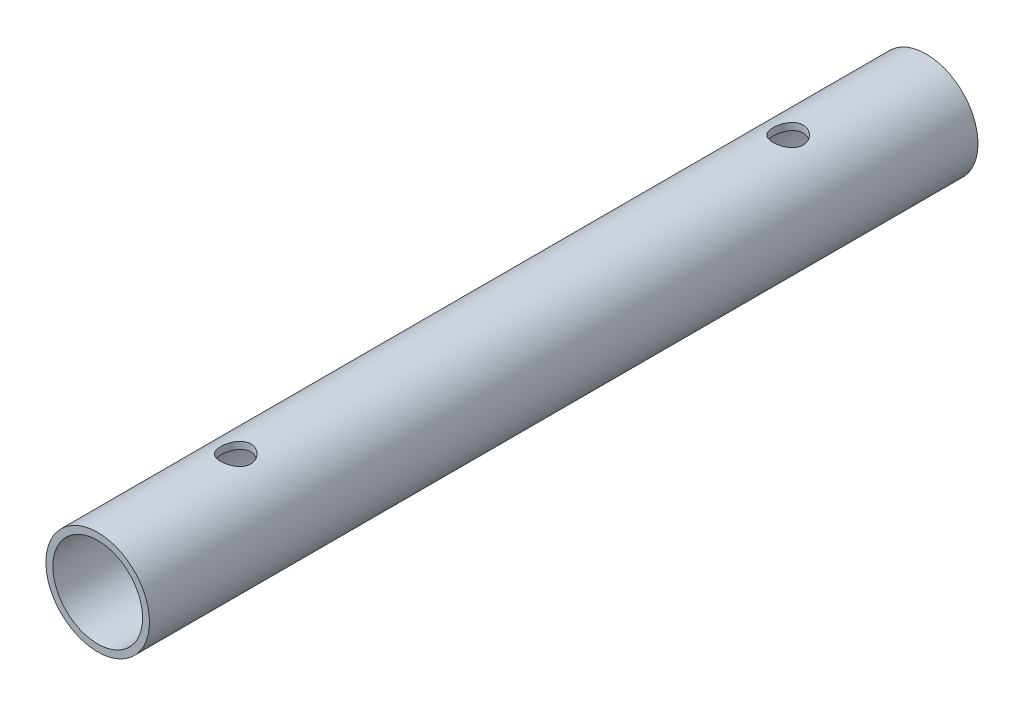
ISO-10303-21;
HEADER;
FILE_DESCRIPTION(('STEP AP214'),'2;1');
FILE_NAME('part.step','',(''),(''),'','','');
FILE_SCHEMA(('AUTOMOTIVE_DESIGN { 1 0 10303 214 1 1 1 1 }'));
ENDSEC;
DATA;
#1=APPLICATION_CONTEXT('core data for automotive mechanical design processes');
#2=APPLICATION_PROTOCOL_DEFINITION('international standard','automotive_design',2000,#1);
#3=PRODUCT_CONTEXT('',#1,'mechanical');
#4=PRODUCT('Part','Part','',(#3));
#5=PRODUCT_RELATED_PRODUCT_CATEGORY('part','',(#4));
#6=PRODUCT_DEFINITION_FORMATION('','',#4);
#7=PRODUCT_DEFINITION_CONTEXT('part definition',#1,'design');
#8=PRODUCT_DEFINITION('design','',#6,#7);
#9=PRODUCT_DEFINITION_SHAPE('','',#8);
#10=(LENGTH_UNIT() NAMED_UNIT(*) SI_UNIT(.MILLI.,.METRE.));
#11=(NAMED_UNIT(*) PLANE_ANGLE_UNIT() SI_UNIT($,.RADIAN.));
#12=(NAMED_UNIT(*) SI_UNIT($,.STERADIAN.) SOLID_ANGLE_UNIT());
#13=UNCERTAINTY_MEASURE_WITH_UNIT(LENGTH_MEASURE(1.E-05),#10,'distance_accuracy_value','');
#14=(GEOMETRIC_REPRESENTATION_CONTEXT(3) GLOBAL_UNCERTAINTY_ASSIGNED_CONTEXT((#13)) GLOBAL_UNIT_ASSIGNED_CONTEXT((#10,
#11,#12)) REPRESENTATION_CONTEXT('',''));
#15=CARTESIAN_POINT('',(0.,0.,0.));
#16=DIRECTION('',(0.,0.,1.));
#17=DIRECTION('',(1.,0.,0.));
#18=AXIS2_PLACEMENT_3D('',#15,#16,#17);
#19=CARTESIAN_POINT('',(0.,0.,-358.681536726415));
#20=DIRECTION('',(0.,0.,1.));
#21=DIRECTION('',(1.,0.,0.));
#22=AXIS2_PLACEMENT_3D('',#19,#20,#21);
#23=CYLINDRICAL_SURFACE('',#22,19.05);
#24=CARTESIAN_POINT('',(0.,0.,0.));
#25=DIRECTION('',(0.,0.,1.));
#26=DIRECTION('',(1.,0.,0.));
#27=AXIS2_PLACEMENT_3D('',#24,#25,#26);
#28=CIRCLE('',#27,19.05);
#29=CARTESIAN_POINT('',(19.05,0.,0.));
#30=VERTEX_POINT('',#29);
#31=EDGE_CURVE('E48',#30,#30,#28,.T.);
#32=ORIENTED_EDGE('',*,*,#31,.F.);
#33=EDGE_LOOP('',(#32));
#34=FACE_BOUND('',#33,.T.);
#35=CARTESIAN_POINT('',(0.,0.,-304.8));
#36=DIRECTION('',(0.,0.,-1.));
#37=DIRECTION('',(0.,1.,0.));
#38=AXIS2_PLACEMENT_3D('',#35,#36,#37);
#39=CIRCLE('',#38,19.05);
#40=CARTESIAN_POINT('',(0.,19.05,-304.8));
#41=VERTEX_POINT('',#40);
#42=EDGE_CURVE('E57',#41,#41,#39,.F.);
#43=ORIENTED_EDGE('',*,*,#42,.T.);
#44=EDGE_LOOP('',(#43));
#45=FACE_BOUND('',#44,.T.);
#46=CARTESIAN_POINT('',(0.,19.05,-56.35625));
#47=CARTESIAN_POINT('',(0.305197852957572,19.0499967593656,-56.3562452855948));
#48=CARTESIAN_POINT('',(0.610443721254728,19.04259502865,-56.3310201483082));
#49=CARTESIAN_POINT('',(1.21207106492609,19.0137899802685,-56.2310095974832));
#50=CARTESIAN_POINT('',(1.50844944236132,18.9923818277056,-56.156207070137));
#51=CARTESIAN_POINT('',(2.08357574543337,18.9379141773575,-55.9597337553705));
#52=CARTESIAN_POINT('',(2.36234818506784,18.9048713209344,-55.8381298859044));
#53=CARTESIAN_POINT('',(2.89554578253322,18.8305835067855,-55.5517734479198));
#54=CARTESIAN_POINT('',(3.14996809945047,18.7893375937379,-55.3870158530418));
#55=CARTESIAN_POINT('',(3.63418633990808,18.7017985246687,-55.0142885747957));
#56=CARTESIAN_POINT('',(3.8632236566638,18.6554062618649,-54.8053566837375));
#57=CARTESIAN_POINT('',(4.28355654099156,18.5634058154964,-54.352263885439));
#58=CARTESIAN_POINT('',(4.47484617120299,18.5177977563079,-54.1080974465714));
#59=CARTESIAN_POINT('',(4.81816843938339,18.4314904262148,-53.5851428068572));
#60=CARTESIAN_POINT('',(4.96928907087044,18.3909148222254,-53.3057335529916));
#61=CARTESIAN_POINT('',(5.22209367570295,18.3207416053292,-52.7240942075278));
#62=CARTESIAN_POINT('',(5.32378878913775,18.2911415189916,-52.421869276147));
#63=CARTESIAN_POINT('',(5.47214625291467,18.247301082059,-51.81166730067));
#64=CARTESIAN_POINT('',(5.52020133630383,18.2326728793863,-51.5040574645368));
#65=CARTESIAN_POINT('',(5.56426199642803,18.2192773099229,-50.8848207872725));
#66=CARTESIAN_POINT('',(5.56027941268827,18.2205063353207,-50.5731948759908));
#67=CARTESIAN_POINT('',(5.50147475001922,18.2383417195535,-49.9659759041382));
#68=CARTESIAN_POINT('',(5.44838154643727,18.2544251203865,-49.6701975373336));
#69=CARTESIAN_POINT('',(5.29564973051496,18.299313291821,-49.091942675106));
#70=CARTESIAN_POINT('',(5.19600675179311,18.3281192557886,-48.8094674302563));
#71=CARTESIAN_POINT('',(4.95169587736092,18.3956350696536,-48.2615367254907));
#72=CARTESIAN_POINT('',(4.80645560148868,18.4344696423172,-47.9963525008436));
#73=CARTESIAN_POINT('',(4.47547110285111,18.5176052201316,-47.4935335128724));
#74=CARTESIAN_POINT('',(4.28971753138748,18.5619074859608,-47.2559051276496));
#75=CARTESIAN_POINT('',(3.87432679086706,18.6531222739158,-46.8051178353809));
#76=CARTESIAN_POINT('',(3.64325026483736,18.7000689061365,-46.5932899910498));
#77=CARTESIAN_POINT('',(3.14827065571151,18.7897329549577,-46.2110917910002));
#78=CARTESIAN_POINT('',(2.88436572714628,18.8324501335542,-46.0407237675642));
#79=CARTESIAN_POINT('',(2.32889511331043,18.9091967961887,-45.7455322566976));
#80=CARTESIAN_POINT('',(2.03717211372351,18.9431722966634,-45.6209898226991));
#81=CARTESIAN_POINT('',(1.43570302112554,18.9982185370377,-45.4231210825474));
#82=CARTESIAN_POINT('',(1.12596169270964,19.0192926716187,-45.3497813029444));
#83=CARTESIAN_POINT('',(0.508575303740116,19.0456308433475,-45.2585827413815));
#84=CARTESIAN_POINT('',(0.201218464925073,19.0514091475778,-45.2389185739891));
#85=CARTESIAN_POINT('',(-0.41241648279452,19.048005485797,-45.2505885632524));
#86=CARTESIAN_POINT('',(-0.71869472225038,19.038825397383,-45.2819163193348));
#87=CARTESIAN_POINT('',(-1.31476061235856,19.006872072053,-45.3932149881674));
#88=CARTESIAN_POINT('',(-1.60476000906639,18.9843903388586,-45.4721434341759));
#89=CARTESIAN_POINT('',(-2.16734740494981,18.9284202360177,-45.675160171376));
#90=CARTESIAN_POINT('',(-2.43993335134991,18.8949305715561,-45.7992537753329));
#91=CARTESIAN_POINT('',(-2.9666964196714,18.8195015702674,-46.0921904479054));
#92=CARTESIAN_POINT('',(-3.22032824532238,18.7773906362024,-46.2619687247643));
#93=CARTESIAN_POINT('',(-3.69612215069487,18.6895643238074,-46.6403091487581));
#94=CARTESIAN_POINT('',(-3.91827674742734,18.6438480924078,-46.8488804908919));
#95=CARTESIAN_POINT('',(-4.33267353503362,18.5520102172859,-47.3073582374873));
#96=CARTESIAN_POINT('',(-4.52363339074842,18.5059281492268,-47.5584340415914));
#97=CARTESIAN_POINT('',(-4.86078376290735,18.4202511103015,-48.0900643884328));
#98=CARTESIAN_POINT('',(-5.00697569449914,18.380655934398,-48.3706179989779));
#99=CARTESIAN_POINT('',(-5.2493975394054,18.3128967342081,-48.9521787919837));
#100=CARTESIAN_POINT('',(-5.34588042295199,18.2846749935688,-49.2530734175867));
#101=CARTESIAN_POINT('',(-5.48655310120297,18.2429636363391,-49.8678057224405));
#102=CARTESIAN_POINT('',(-5.53075958266918,18.2294693188235,-50.1816392384444));
#103=CARTESIAN_POINT('',(-5.56453342166491,18.2191860189346,-50.8000715682928));
#104=CARTESIAN_POINT('',(-5.55618304605885,18.22176037238,-51.1045476189261));
#105=CARTESIAN_POINT('',(-5.49001416113235,18.2418040071718,-51.7075511849054));
#106=CARTESIAN_POINT('',(-5.43219743485723,18.2592727516405,-52.0060789142653));
#107=CARTESIAN_POINT('',(-5.27004750008392,18.3067217834013,-52.5855126310295));
#108=CARTESIAN_POINT('',(-5.16623697127978,18.336561249887,-52.8665772594015));
#109=CARTESIAN_POINT('',(-4.91545129484854,18.4053706773781,-53.4075235064469));
#110=CARTESIAN_POINT('',(-4.76846824512327,18.4443423096286,-53.6674012360337));
#111=CARTESIAN_POINT('',(-4.42954181865279,18.5287105848625,-54.1683323230018));
#112=CARTESIAN_POINT('',(-4.23621715797442,18.5742830513715,-54.4084215281945));
#113=CARTESIAN_POINT('',(-3.81261787180827,18.6658331490876,-54.8534262206816));
#114=CARTESIAN_POINT('',(-3.58233383745699,18.7118108806401,-55.0583327238386));
#115=CARTESIAN_POINT('',(-3.08383042936397,18.8004843675626,-55.4326727624395));
#116=CARTESIAN_POINT('',(-2.81475200197527,18.843057385642,-55.6009942592762));
#117=CARTESIAN_POINT('',(-2.25087323533568,18.9186883530335,-55.8897639173367));
#118=CARTESIAN_POINT('',(-1.95608622414199,18.9517511949234,-56.0102367068599));
#119=CARTESIAN_POINT('',(-1.3862214397385,19.0013821268529,-56.1877875140526));
#120=CARTESIAN_POINT('',(-1.11311117563594,19.0194679486894,-56.2507964090226));
#121=CARTESIAN_POINT('',(-0.56001340421481,19.0437775008748,-56.3350267461973));
#122=CARTESIAN_POINT('',(-0.280026913051773,19.0500029733657,-56.3562543255886));
#123=CARTESIAN_POINT('',(0.,19.05,-56.35625));
#124=B_SPLINE_CURVE_WITH_KNOTS('',3,(#46,#47,#48,#49,#50,#51,#52,#53,#54,#55,#56,#57,#58,#59,
#60,#61,#62,#63,#64,#65,#66,#67,#68,#69,#70,#71,#72,#73,#74,#75,#76,#77,#78,#79,#80,#81,#82,#83,
#84,#85,#86,#87,#88,#89,#90,#91,#92,#93,#94,#95,#96,#97,#98,#99,#100,#101,#102,#103,#104,#105,
#106,#107,#108,#109,#110,#111,#112,#113,#114,#115,#116,#117,#118,#119,#120,#121,#122,#123),
.UNSPECIFIED.,.T.,.F.,(4,2,2,2,2,2,2,2,2,2,2,2,2,2,2,2,2,2,2,2,2,2,2,2,2,2,2,2,2,2,2,2,2,2,2,2,
2,2,4),(0.,0.914565397239843,1.82944666132989,2.74302463181422,3.65670905927188,
4.59284136918555,5.52912080685836,6.48512645713506,7.44091653186592,8.37126685477797,
9.30140550958779,10.1999971835512,11.0986731625854,12.0091144550199,12.9197660602199,
13.8662568603019,14.8128008920191,15.7650570613528,16.7170625597679,17.6366279867662,
18.5560779976049,19.4560880742055,20.3562040529807,21.2763697970838,22.1967539237818,
23.1486047804499,24.1004255452921,25.0473534055484,25.9939789223403,26.9033423712759,
27.8126730430221,28.7119249232661,29.6113415010842,30.5419197534044,31.4727352828109,
32.4287806250415,33.3843332396459,34.2235939007218,35.0627312750225),.UNSPECIFIED.);
#125=CARTESIAN_POINT('',(0.,19.05,-56.35625));
#126=VERTEX_POINT('',#125);
#127=EDGE_CURVE('E59',#126,#126,#124,.T.);
#128=ORIENTED_EDGE('',*,*,#127,.T.);
#129=EDGE_LOOP('',(#128));
#130=FACE_BOUND('',#129,.T.);
#131=CARTESIAN_POINT('',(2.55069435326411E-13,19.05,-259.55625));
#132=CARTESIAN_POINT('',(0.305197852957828,19.0499967593656,-259.556245285595));
#133=CARTESIAN_POINT('',(0.610443721254984,19.04259502865,-259.531020148308));
#134=CARTESIAN_POINT('',(1.21207106492634,19.0137899802685,-259.431009597483));
#135=CARTESIAN_POINT('',(1.50844944236157,18.9923818277055,-259.356207070137));
#136=CARTESIAN_POINT('',(2.08357574543362,18.9379141773575,-259.159733755371));
#137=CARTESIAN_POINT('',(2.36234818506809,18.9048713209344,-259.038129885904));
#138=CARTESIAN_POINT('',(2.89554578253347,18.8305835067855,-258.75177344792));
#139=CARTESIAN_POINT('',(3.14996809945071,18.7893375937379,-258.587015853042));
#140=CARTESIAN_POINT('',(3.63418633990831,18.7017985246686,-258.214288574796));
#141=CARTESIAN_POINT('',(3.86322365666404,18.6554062618648,-258.005356683737));
#142=CARTESIAN_POINT('',(4.28355654099181,18.5634058154963,-257.552263885439));
#143=CARTESIAN_POINT('',(4.47484617120324,18.5177977563078,-257.308097446571));
#144=CARTESIAN_POINT('',(4.81816843938362,18.4314904262147,-256.785142806857));
#145=CARTESIAN_POINT('',(4.96928907087067,18.3909148222253,-256.505733552992));
#146=CARTESIAN_POINT('',(5.22209367570318,18.3207416053292,-255.924094207528));
#147=CARTESIAN_POINT('',(5.32378878913798,18.2911415189916,-255.621869276147));
#148=CARTESIAN_POINT('',(5.4721462529149,18.247301082059,-255.01166730067));
#149=CARTESIAN_POINT('',(5.52020133630405,18.2326728793862,-254.704057464537));
#150=CARTESIAN_POINT('',(5.56426199642825,18.2192773099228,-254.084820787272));
#151=CARTESIAN_POINT('',(5.56027941268849,18.2205063353206,-253.773194875991));
#152=CARTESIAN_POINT('',(5.50147475001944,18.2383417195535,-253.165975904138));
#153=CARTESIAN_POINT('',(5.44838154643748,18.2544251203864,-252.870197537334));
#154=CARTESIAN_POINT('',(5.29564973051516,18.299313291821,-252.291942675106));
#155=CARTESIAN_POINT('',(5.19600675179333,18.3281192557885,-252.009467430256));
#156=CARTESIAN_POINT('',(4.95169587736115,18.3956350696535,-251.461536725491));
#157=CARTESIAN_POINT('',(4.80645560148891,18.4344696423172,-251.196352500844));
#158=CARTESIAN_POINT('',(4.47547110285133,18.5176052201315,-250.693533512872));
#159=CARTESIAN_POINT('',(4.2897175313877,18.5619074859608,-250.45590512765));
#160=CARTESIAN_POINT('',(3.87432679086727,18.6531222739158,-250.005117835381));
#161=CARTESIAN_POINT('',(3.64325026483758,18.7000689061365,-249.79328999105));
#162=CARTESIAN_POINT('',(3.14827065571174,18.7897329549577,-249.411091791));
#163=CARTESIAN_POINT('',(2.88436572714651,18.8324501335542,-249.240723767564));
#164=CARTESIAN_POINT('',(2.32889511331066,18.9091967961887,-248.945532256698));
#165=CARTESIAN_POINT('',(2.03717211372375,18.9431722966634,-248.820989822699));
#166=CARTESIAN_POINT('',(1.43570302112578,18.9982185370377,-248.623121082547));
#167=CARTESIAN_POINT('',(1.12596169270988,19.0192926716187,-248.549781302944));
#168=CARTESIAN_POINT('',(0.508575303740361,19.0456308433475,-248.458582741382));
#169=CARTESIAN_POINT('',(0.201218464925319,19.0514091475778,-248.438918573989));
#170=CARTESIAN_POINT('',(-0.412416482794271,19.048005485797,-248.450588563252));
#171=CARTESIAN_POINT('',(-0.718694722250129,19.038825397383,-248.481916319335));
#172=CARTESIAN_POINT('',(-1.31476061235831,19.006872072053,-248.593214988167));
#173=CARTESIAN_POINT('',(-1.60476000906614,18.9843903388586,-248.672143434176));
#174=CARTESIAN_POINT('',(-2.16734740494956,18.9284202360177,-248.875160171376));
#175=CARTESIAN_POINT('',(-2.43993335134966,18.8949305715561,-248.999253775333));
#176=CARTESIAN_POINT('',(-2.96669641967114,18.8195015702675,-249.292190447905));
#177=CARTESIAN_POINT('',(-3.22032824532211,18.7773906362025,-249.461968724764));
#178=CARTESIAN_POINT('',(-3.6961221506946,18.6895643238074,-249.840309148758));
#179=CARTESIAN_POINT('',(-3.91827674742707,18.6438480924078,-250.048880490892));
#180=CARTESIAN_POINT('',(-4.33267353503336,18.5520102172859,-250.507358237487));
#181=CARTESIAN_POINT('',(-4.52363339074816,18.5059281492269,-250.758434041591));
#182=CARTESIAN_POINT('',(-4.86078376290709,18.4202511103016,-251.290064388433));
#183=CARTESIAN_POINT('',(-5.00697569449887,18.3806559343981,-251.570617998978));
#184=CARTESIAN_POINT('',(-5.2493975394051,18.3128967342082,-252.152178791984));
#185=CARTESIAN_POINT('',(-5.34588042295169,18.2846749935689,-252.453073417587));
#186=CARTESIAN_POINT('',(-5.48655310120267,18.2429636363392,-253.06780572244));
#187=CARTESIAN_POINT('',(-5.53075958266889,18.2294693188236,-253.381639238444));
#188=CARTESIAN_POINT('',(-5.56453342166462,18.2191860189346,-254.000071568293));
#189=CARTESIAN_POINT('',(-5.55618304605857,18.2217603723801,-254.304547618926));
#190=CARTESIAN_POINT('',(-5.49001416113207,18.2418040071719,-254.907551184905));
#191=CARTESIAN_POINT('',(-5.43219743485695,18.2592727516406,-255.206078914265));
#192=CARTESIAN_POINT('',(-5.27004750008364,18.3067217834014,-255.785512631029));
#193=CARTESIAN_POINT('',(-5.1662369712795,18.3365612498871,-256.066577259402));
#194=CARTESIAN_POINT('',(-4.91545129484825,18.4053706773782,-256.607523506447));
#195=CARTESIAN_POINT('',(-4.76846824512297,18.4443423096286,-256.867401236034));
#196=CARTESIAN_POINT('',(-4.42954181865248,18.5287105848626,-257.368332323002));
#197=CARTESIAN_POINT('',(-4.23621715797411,18.5742830513716,-257.608421528195));
#198=CARTESIAN_POINT('',(-3.81261787180797,18.6658331490877,-258.053426220682));
#199=CARTESIAN_POINT('',(-3.5823338374567,18.7118108806402,-258.258332723839));
#200=CARTESIAN_POINT('',(-3.08383042936368,18.8004843675626,-258.632672762439));
#201=CARTESIAN_POINT('',(-2.81475200197498,18.843057385642,-258.800994259276));
#202=CARTESIAN_POINT('',(-2.25087323533538,18.9186883530336,-259.089763917337));
#203=CARTESIAN_POINT('',(-1.9560862241417,18.9517511949234,-259.21023670686));
#204=CARTESIAN_POINT('',(-1.38622143973821,19.0013821268529,-259.387787514053));
#205=CARTESIAN_POINT('',(-1.11311117563566,19.0194679486895,-259.450796409023));
#206=CARTESIAN_POINT('',(-0.560013404214543,19.0437775008748,-259.535026746197));
#207=CARTESIAN_POINT('',(-0.280026913051512,19.0500029733657,-259.556254325589));
#208=CARTESIAN_POINT('',(2.55069435326411E-13,19.05,-259.55625));
#209=B_SPLINE_CURVE_WITH_KNOTS('',3,(#131,#132,#133,#134,#135,#136,#137,#138,#139,#140,#141,
#142,#143,#144,#145,#146,#147,#148,#149,#150,#151,#152,#153,#154,#155,#156,#157,#158,#159,#160,
#161,#162,#163,#164,#165,#166,#167,#168,#169,#170,#171,#172,#173,#174,#175,#176,#177,#178,#179,
#180,#181,#182,#183,#184,#185,#186,#187,#188,#189,#190,#191,#192,#193,#194,#195,#196,#197,#198,
#199,#200,#201,#202,#203,#204,#205,#206,#207,#208),.UNSPECIFIED.,.T.,.F.,(4,2,2,2,2,2,2,2,2,2,2,
2,2,2,2,2,2,2,2,2,2,2,2,2,2,2,2,2,2,2,2,2,2,2,2,2,2,2,4),(0.,0.914565397239846,1.82944666132989,
2.7430246318142,3.65670905927187,4.59284136918554,5.52912080685835,6.48512645713502,
7.44091653186594,8.371266854778,9.30140550958774,10.1999971835512,11.0986731625854,
12.0091144550199,12.9197660602199,13.8662568603019,14.8128008920191,15.7650570613527,
16.7170625597678,17.6366279867661,18.5560779976049,19.4560880742054,20.3562040529807,
21.2763697970837,22.1967539237817,23.1486047804499,24.100425545292,25.0473534055481,
25.9939789223401,26.9033423712756,27.8126730430219,28.711924923266,29.611341501084,
30.5419197534043,31.4727352828107,32.4287806250413,33.3843332396457,34.2235939007216,
35.0627312750223),.UNSPECIFIED.);
#210=CARTESIAN_POINT('',(2.55069435326411E-13,19.05,-259.55625));
#211=VERTEX_POINT('',#210);
#212=EDGE_CURVE('E65',#211,#211,#209,.T.);
#213=ORIENTED_EDGE('',*,*,#212,.T.);
#214=EDGE_LOOP('',(#213));
#215=FACE_BOUND('',#214,.T.);
#216=ADVANCED_FACE('F37',(#34,#45,#130,#215),#23,.T.);
#217=CARTESIAN_POINT('',(0.,0.,-358.681536726415));
#218=DIRECTION('',(0.,0.,1.));
#219=DIRECTION('',(1.,0.,0.));
#220=AXIS2_PLACEMENT_3D('',#217,#218,#219);
#221=CYLINDRICAL_SURFACE('',#220,16.51);
#222=CARTESIAN_POINT('',(0.,0.,0.));
#223=DIRECTION('',(0.,0.,1.));
#224=DIRECTION('',(1.,0.,0.));
#225=AXIS2_PLACEMENT_3D('',#222,#223,#224);
#226=CIRCLE('',#225,16.51);
#227=CARTESIAN_POINT('',(16.51,0.,0.));
#228=VERTEX_POINT('',#227);
#229=EDGE_CURVE('E53',#228,#228,#226,.T.);
#230=ORIENTED_EDGE('',*,*,#229,.T.);
#231=EDGE_LOOP('',(#230));
#232=FACE_BOUND('',#231,.T.);
#233=CARTESIAN_POINT('',(0.,0.,-304.8));
#234=DIRECTION('',(0.,0.,-1.));
#235=DIRECTION('',(0.,1.,0.));
#236=AXIS2_PLACEMENT_3D('',#233,#234,#235);
#237=CIRCLE('',#236,16.51);
#238=CARTESIAN_POINT('',(0.,16.51,-304.8));
#239=VERTEX_POINT('',#238);
#240=EDGE_CURVE('E11',#239,#239,#237,.F.);
#241=ORIENTED_EDGE('',*,*,#240,.F.);
#242=EDGE_LOOP('',(#241));
#243=FACE_BOUND('',#242,.T.);
#244=CARTESIAN_POINT('',(0.,16.51,-56.35625));
#245=CARTESIAN_POINT('',(0.303001841283657,16.5100012892281,-56.356252073869));
#246=CARTESIAN_POINT('',(0.605990410069188,16.5015821053426,-56.3313841554873));
#247=CARTESIAN_POINT('',(1.20303360690917,16.4688263258854,-56.232879994899));
#248=CARTESIAN_POINT('',(1.49708747551377,16.4444883811571,-56.1592396190928));
#249=CARTESIAN_POINT('',(2.06756578453752,16.3825377872883,-55.9660111380148));
#250=CARTESIAN_POINT('',(2.34401911939063,16.3449475941776,-55.8465007296428));
#251=CARTESIAN_POINT('',(2.87296195697247,16.2603205153569,-55.565265916127));
#252=CARTESIAN_POINT('',(3.1254465765243,16.2132817107256,-55.4035329339856));
#253=CARTESIAN_POINT('',(3.60815035265068,16.1128553309971,-55.0365135667951));
#254=CARTESIAN_POINT('',(3.83740810602859,16.0593136044893,-54.8300074377264));
#255=CARTESIAN_POINT('',(4.25885273676261,15.9527303852888,-54.3817083061658));
#256=CARTESIAN_POINT('',(4.4510312380624,15.8996890081909,-54.1399073523307));
#257=CARTESIAN_POINT('',(4.7100962874638,15.8241438126973,-53.7516390689174));
#258=CARTESIAN_POINT('',(4.79256176448533,15.7992999408971,-53.6157726411509));
#259=CARTESIAN_POINT('',(4.94569769398047,15.7520344639444,-53.3371666447779));
#260=CARTESIAN_POINT('',(5.01637281997975,15.7296119002692,-53.1944298285424));
#261=CARTESIAN_POINT('',(5.14535467052054,15.6878942771986,-52.9030084048303));
#262=CARTESIAN_POINT('',(5.20365924700868,15.6685997611023,-52.7543227697047));
#263=CARTESIAN_POINT('',(5.30733676970054,15.6337861342281,-52.452146278819));
#264=CARTESIAN_POINT('',(5.35271563304869,15.6182652964105,-52.2986576576049));
#265=CARTESIAN_POINT('',(5.4288123235241,15.5919743175185,-51.9932450938625));
#266=CARTESIAN_POINT('',(5.45997454891679,15.5810611117116,-51.8414441478064));
#267=CARTESIAN_POINT('',(5.50952093312797,15.5636104851087,-51.535582899151));
#268=CARTESIAN_POINT('',(5.52791043792858,15.5570712336501,-51.3815235693938));
#269=CARTESIAN_POINT('',(5.55174009389249,15.5485833020223,-51.0722915995881));
#270=CARTESIAN_POINT('',(5.55718120928279,15.546634280033,-50.9171190433014));
#271=CARTESIAN_POINT('',(5.55505887104725,15.5473928055721,-50.6068766988716));
#272=CARTESIAN_POINT('',(5.54749579369548,15.5501002183675,-50.4518069078849));
#273=CARTESIAN_POINT('',(5.5201062343431,15.5598433092289,-50.1502480680302));
#274=CARTESIAN_POINT('',(5.50087218239464,15.566669810147,-50.003697970311));
#275=CARTESIAN_POINT('',(5.45083931117455,15.5842597966188,-49.7127756523919));
#276=CARTESIAN_POINT('',(5.42003660307032,15.5950246060134,-49.5684041815369));
#277=CARTESIAN_POINT('',(5.34715236943882,15.6201646715155,-49.2829056064336));
#278=CARTESIAN_POINT('',(5.30507399443081,15.6345389190443,-49.1417776078721));
#279=CARTESIAN_POINT('',(5.20997196498643,15.6664867586099,-48.8635784977247));
#280=CARTESIAN_POINT('',(5.15694413886454,15.684061569743,-48.7265089552155));
#281=CARTESIAN_POINT('',(5.03942842900177,15.7222178547558,-48.4551601480778));
#282=CARTESIAN_POINT('',(4.97477142888395,15.7428427684737,-48.3209601264611));
#283=CARTESIAN_POINT('',(4.83506870752406,15.7863094006055,-48.0584371526363));
#284=CARTESIAN_POINT('',(4.76001921585692,15.8091519226709,-47.9301163560166));
#285=CARTESIAN_POINT('',(4.52003392991684,15.8800884234944,-47.5551362476319));
#286=CARTESIAN_POINT('',(4.34017657616631,15.9306201021002,-47.3182644700239));
#287=CARTESIAN_POINT('',(3.93475374141589,16.0357065165112,-46.8646307019202));
#288=CARTESIAN_POINT('',(3.70726341756586,16.090332149195,-46.6496127285579));
#289=CARTESIAN_POINT('',(3.21875827046269,16.1951231451127,-46.2602848660341));
#290=CARTESIAN_POINT('',(2.95774011041215,16.2452880635599,-46.0859790335479));
#291=CARTESIAN_POINT('',(2.40587655728287,16.3361794028346,-45.7816377862093));
#292=CARTESIAN_POINT('',(2.11475205233691,16.3768034637846,-45.6520760322672));
#293=CARTESIAN_POINT('',(1.51314280705963,16.443293718228,-45.4443038677247));
#294=CARTESIAN_POINT('',(1.20266497034036,16.469165141158,-45.3660752593401));
#295=CARTESIAN_POINT('',(0.585861933875081,16.5023644340805,-45.2662894410785));
#296=CARTESIAN_POINT('',(0.279957089330935,16.5104595259741,-45.2423858778344));
#297=CARTESIAN_POINT('',(-0.331559379273983,16.5095001533181,-45.2452339330729));
#298=CARTESIAN_POINT('',(-0.637171044814264,16.5004486469684,-45.2719768138275));
#299=CARTESIAN_POINT('',(-1.22997812823469,16.466720274744,-45.3735040951045));
#300=CARTESIAN_POINT('',(-1.51745091302877,16.442514401495,-45.4468413424197));
#301=CARTESIAN_POINT('',(-2.0758972155844,16.3813831314297,-45.6376698205895));
#302=CARTESIAN_POINT('',(-2.34686861671688,16.344456106901,-45.7551667019869));
#303=CARTESIAN_POINT('',(-2.87261941279041,16.2604115968944,-46.034396741929));
#304=CARTESIAN_POINT('',(-3.12677698071994,16.2130493369225,-46.1972226935294));
#305=CARTESIAN_POINT('',(-3.605014181911,16.1134628129162,-46.5613609068262));
#306=CARTESIAN_POINT('',(-3.82908443602246,16.0612370413268,-46.7626851224353));
#307=CARTESIAN_POINT('',(-4.14334277524867,15.9820298961403,-47.0946823185482));
#308=CARTESIAN_POINT('',(-4.24646864049466,15.9548718234462,-47.2133377795246));
#309=CARTESIAN_POINT('',(-4.44237835324271,15.9014358397904,-47.4590656536666));
#310=CARTESIAN_POINT('',(-4.53516583285586,15.8751576219996,-47.5861350856395));
#311=CARTESIAN_POINT('',(-4.70979751133323,15.8242280625548,-47.8479660320033));
#312=CARTESIAN_POINT('',(-4.79163693309175,15.7995774334479,-47.9827308678695));
#313=CARTESIAN_POINT('',(-4.94368918737288,15.7526621911914,-48.258996874536));
#314=CARTESIAN_POINT('',(-5.0139068810071,15.7303965818228,-48.4004951968184));
#315=CARTESIAN_POINT('',(-5.14210081255947,15.6889590405373,-48.6891651246918));
#316=CARTESIAN_POINT('',(-5.20009176928894,15.6697833954886,-48.83632965373));
#317=CARTESIAN_POINT('',(-5.30339921933076,15.6351216044407,-49.1354017084733));
#318=CARTESIAN_POINT('',(-5.34872093201209,15.619633939489,-49.2873072522582));
#319=CARTESIAN_POINT('',(-5.42627367861624,15.5928618136525,-49.5947620289819));
#320=CARTESIAN_POINT('',(-5.4585070565084,15.5815766001872,-49.7503106042137));
#321=CARTESIAN_POINT('',(-5.50955789813511,15.5635988071455,-50.0638541847196));
#322=CARTESIAN_POINT('',(-5.52837605572875,15.5569059900428,-50.2218490630346));
#323=CARTESIAN_POINT('',(-5.5517629892085,15.5485745485737,-50.5306578398517));
#324=CARTESIAN_POINT('',(-5.55702873906839,15.5466887606216,-50.6814126916219));
#325=CARTESIAN_POINT('',(-5.55528518212247,15.5473119360311,-50.9828956956971));
#326=CARTESIAN_POINT('',(-5.54827170547826,15.5498223922903,-51.1336238215423));
#327=CARTESIAN_POINT('',(-5.5220366784935,15.5591581806091,-51.4338101751144));
#328=CARTESIAN_POINT('',(-5.50282048432806,15.5659816195523,-51.5832689308572));
#329=CARTESIAN_POINT('',(-5.4523643519472,15.5837266488679,-51.8799491075719));
#330=CARTESIAN_POINT('',(-5.42111989594495,15.5946497790361,-52.027169666259));
#331=CARTESIAN_POINT('',(-5.34764238102227,15.6199967783827,-52.315351938352));
#332=CARTESIAN_POINT('',(-5.30564373730794,15.6343455732369,-52.4563800007554));
#333=CARTESIAN_POINT('',(-5.21073535089766,15.666232230828,-52.7343618647713));
#334=CARTESIAN_POINT('',(-5.15782172666254,15.6837712277879,-52.8713141971105));
#335=CARTESIAN_POINT('',(-4.98330866759867,15.740450114062,-53.2747193318351));
#336=CARTESIAN_POINT('',(-4.84587858027642,15.7836731178632,-53.5339477567452));
#337=CARTESIAN_POINT('',(-4.52578919730844,15.8784854587163,-54.0376246983558));
#338=CARTESIAN_POINT('',(-4.34139503556547,15.9303607255121,-54.280908683976));
#339=CARTESIAN_POINT('',(-3.93547143305105,16.0354629214635,-54.734017998214));
#340=CARTESIAN_POINT('',(-3.71393139844057,16.0886902325312,-54.9438337484336));
#341=CARTESIAN_POINT('',(-3.22937916856912,16.1930526646775,-55.3324696953642));
#342=CARTESIAN_POINT('',(-2.96506213236115,16.2440188224981,-55.5097135223922));
#343=CARTESIAN_POINT('',(-2.40869611548786,16.3357774074034,-55.8170731297389));
#344=CARTESIAN_POINT('',(-2.11665361417938,16.3765722034626,-55.9471998871211));
#345=CARTESIAN_POINT('',(-1.5246008657399,16.4420475730348,-56.1518035131818));
#346=CARTESIAN_POINT('',(-1.2253244626449,16.4672856018639,-56.2282213202713));
#347=CARTESIAN_POINT('',(-0.617358946743224,16.5012587688668,-56.3304361768504));
#348=CARTESIAN_POINT('',(-0.308672586400463,16.5099986866438,-56.3562478873181));
#349=CARTESIAN_POINT('',(0.,16.51,-56.35625));
#350=B_SPLINE_CURVE_WITH_KNOTS('',3,(#244,#245,#246,#247,#248,#249,#250,#251,#252,#253,#254,
#255,#256,#257,#258,#259,#260,#261,#262,#263,#264,#265,#266,#267,#268,#269,#270,#271,#272,#273,
#274,#275,#276,#277,#278,#279,#280,#281,#282,#283,#284,#285,#286,#287,#288,#289,#290,#291,#292,
#293,#294,#295,#296,#297,#298,#299,#300,#301,#302,#303,#304,#305,#306,#307,#308,#309,#310,#311,
#312,#313,#314,#315,#316,#317,#318,#319,#320,#321,#322,#323,#324,#325,#326,#327,#328,#329,#330,
#331,#332,#333,#334,#335,#336,#337,#338,#339,#340,#341,#342,#343,#344,#345,#346,#347,#348,#349),
.UNSPECIFIED.,.T.,.F.,(4,2,2,2,2,2,2,2,2,2,2,2,2,2,2,2,2,2,2,2,2,2,2,2,2,2,2,2,2,2,2,2,2,2,2,2,
2,2,2,2,2,2,2,2,2,2,2,2,2,2,2,2,4),(0.,0.907869506561873,1.81581596740486,2.72223124336379,
3.62883078992559,4.56421379429915,5.49980785123622,5.98190720843446,6.46381501196521,
6.94580642682018,7.42757683929737,7.89303440467772,8.35829703666712,8.82352502088533,
9.28873954403844,9.73211253601431,10.1756347025178,10.6190330740581,11.0626006908776,
11.5132349872202,11.9640332053956,12.8649940322994,13.8139609510831,14.7630223873686,
15.7218429647228,16.680323452849,17.5965487304505,18.5126159515892,19.4015363276225,
20.2905704861576,21.2032352646633,22.1161838918764,22.5943256065005,23.0722988057888,
23.5504798896373,24.0284604526649,24.5058622848075,24.9830671501158,25.4601865158202,
25.9372812022703,26.3892993005576,26.8414709270839,27.2934442176296,27.7455874341667,
28.1886085619525,28.6317875074807,29.5174461975389,30.4423641507158,31.3675463364891,
32.3297521187487,33.2917335873937,34.2168621250225,35.1417226061251),.UNSPECIFIED.);
#351=CARTESIAN_POINT('',(0.,16.51,-56.35625));
#352=VERTEX_POINT('',#351);
#353=EDGE_CURVE('E60',#352,#352,#350,.T.);
#354=ORIENTED_EDGE('',*,*,#353,.F.);
#355=EDGE_LOOP('',(#354));
#356=FACE_BOUND('',#355,.T.);
#357=CARTESIAN_POINT('',(2.55069435326411E-13,16.51,-259.55625));
#358=CARTESIAN_POINT('',(0.303001841283911,16.5100012892281,-259.556252073869));
#359=CARTESIAN_POINT('',(0.605990410069442,16.5015821053426,-259.531384155487));
#360=CARTESIAN_POINT('',(1.20303360690942,16.4688263258853,-259.432879994899));
#361=CARTESIAN_POINT('',(1.49708747551402,16.4444883811571,-259.359239619093));
#362=CARTESIAN_POINT('',(2.06756578453776,16.3825377872882,-259.166011138015));
#363=CARTESIAN_POINT('',(2.34401911939085,16.3449475941776,-259.046500729643));
#364=CARTESIAN_POINT('',(2.87296195697269,16.2603205153569,-258.765265916127));
#365=CARTESIAN_POINT('',(3.12544657652454,16.2132817107256,-258.603532933986));
#366=CARTESIAN_POINT('',(3.60815035265093,16.1128553309971,-258.236513566795));
#367=CARTESIAN_POINT('',(3.83740810602883,16.0593136044892,-258.030007437726));
#368=CARTESIAN_POINT('',(4.25885273676286,15.9527303852887,-257.581708306166));
#369=CARTESIAN_POINT('',(4.45103123806265,15.8996890081908,-257.339907352331));
#370=CARTESIAN_POINT('',(4.71009628746403,15.8241438126973,-256.951639068917));
#371=CARTESIAN_POINT('',(4.79256176448556,15.799299940897,-256.815772641151));
#372=CARTESIAN_POINT('',(4.94569769398069,15.7520344639443,-256.537166644778));
#373=CARTESIAN_POINT('',(5.01637281997997,15.7296119002691,-256.394429828542));
#374=CARTESIAN_POINT('',(5.14535467052075,15.6878942771986,-256.10300840483));
#375=CARTESIAN_POINT('',(5.2036592470089,15.6685997611022,-255.954322769705));
#376=CARTESIAN_POINT('',(5.30733676970076,15.633786134228,-255.652146278819));
#377=CARTESIAN_POINT('',(5.35271563304891,15.6182652964104,-255.498657657605));
#378=CARTESIAN_POINT('',(5.42881232352433,15.5919743175184,-255.193245093862));
#379=CARTESIAN_POINT('',(5.45997454891702,15.5810611117116,-255.041444147806));
#380=CARTESIAN_POINT('',(5.5095209331282,15.5636104851086,-254.735582899151));
#381=CARTESIAN_POINT('',(5.52791043792881,15.55707123365,-254.581523569394));
#382=CARTESIAN_POINT('',(5.55174009389272,15.5485833020223,-254.272291599588));
#383=CARTESIAN_POINT('',(5.55718120928301,15.5466342800329,-254.117119043301));
#384=CARTESIAN_POINT('',(5.55505887104747,15.5473928055721,-253.806876698872));
#385=CARTESIAN_POINT('',(5.5474957936957,15.5501002183675,-253.651806907885));
#386=CARTESIAN_POINT('',(5.52010623434331,15.5598433092288,-253.35024806803));
#387=CARTESIAN_POINT('',(5.50087218239485,15.5666698101469,-253.203697970311));
#388=CARTESIAN_POINT('',(5.45083931117474,15.5842597966188,-252.912775652392));
#389=CARTESIAN_POINT('',(5.42003660307051,15.5950246060133,-252.768404181537));
#390=CARTESIAN_POINT('',(5.34715236943901,15.6201646715154,-252.482905606433));
#391=CARTESIAN_POINT('',(5.305073994431,15.6345389190442,-252.341777607872));
#392=CARTESIAN_POINT('',(5.20997196498663,15.6664867586098,-252.063578497725));
#393=CARTESIAN_POINT('',(5.15694413886474,15.684061569743,-251.926508955215));
#394=CARTESIAN_POINT('',(5.03942842900198,15.7222178547557,-251.655160148078));
#395=CARTESIAN_POINT('',(4.97477142888417,15.7428427684736,-251.520960126461));
#396=CARTESIAN_POINT('',(4.83506870752428,15.7863094006055,-251.258437152636));
#397=CARTESIAN_POINT('',(4.76001921585714,15.8091519226708,-251.130116356017));
#398=CARTESIAN_POINT('',(4.52003392991705,15.8800884234943,-250.755136247632));
#399=CARTESIAN_POINT('',(4.34017657616652,15.9306201021001,-250.518264470024));
#400=CARTESIAN_POINT('',(3.9347537414161,16.0357065165111,-250.06463070192));
#401=CARTESIAN_POINT('',(3.70726341756607,16.090332149195,-249.849612728558));
#402=CARTESIAN_POINT('',(3.2187582704629,16.1951231451126,-249.460284866034));
#403=CARTESIAN_POINT('',(2.95774011041236,16.2452880635598,-249.285979033548));
#404=CARTESIAN_POINT('',(2.40587655728309,16.3361794028346,-248.981637786209));
#405=CARTESIAN_POINT('',(2.11475205233714,16.3768034637846,-248.852076032267));
#406=CARTESIAN_POINT('',(1.51314280705987,16.443293718228,-248.644303867725));
#407=CARTESIAN_POINT('',(1.2026649703406,16.4691651411579,-248.56607525934));
#408=CARTESIAN_POINT('',(0.585861933875322,16.5023644340805,-248.466289441078));
#409=CARTESIAN_POINT('',(0.279957089331178,16.5104595259741,-248.442385877834));
#410=CARTESIAN_POINT('',(-0.331559379273737,16.5095001533181,-248.445233933073));
#411=CARTESIAN_POINT('',(-0.637171044814016,16.5004486469684,-248.471976813828));
#412=CARTESIAN_POINT('',(-1.22997812823444,16.4667202747441,-248.573504095105));
#413=CARTESIAN_POINT('',(-1.51745091302851,16.442514401495,-248.64684134242));
#414=CARTESIAN_POINT('',(-2.07589721558414,16.3813831314297,-248.83766982059));
#415=CARTESIAN_POINT('',(-2.34686861671662,16.3444561069011,-248.955166701987));
#416=CARTESIAN_POINT('',(-2.87261941279015,16.2604115968944,-249.234396741929));
#417=CARTESIAN_POINT('',(-3.12677698071969,16.2130493369225,-249.397222693529));
#418=CARTESIAN_POINT('',(-3.60501418191076,16.1134628129163,-249.761360906826));
#419=CARTESIAN_POINT('',(-3.82908443602221,16.0612370413269,-249.962685122435));
#420=CARTESIAN_POINT('',(-4.1433427752484,15.9820298961403,-250.294682318548));
#421=CARTESIAN_POINT('',(-4.24646864049438,15.9548718234463,-250.413337779525));
#422=CARTESIAN_POINT('',(-4.44237835324244,15.9014358397905,-250.659065653667));
#423=CARTESIAN_POINT('',(-4.53516583285559,15.8751576219997,-250.78613508564));
#424=CARTESIAN_POINT('',(-4.70979751133296,15.8242280625549,-251.047966032003));
#425=CARTESIAN_POINT('',(-4.79163693309148,15.799577433448,-251.18273086787));
#426=CARTESIAN_POINT('',(-4.9436891873726,15.7526621911915,-251.458996874536));
#427=CARTESIAN_POINT('',(-5.01390688100682,15.7303965818229,-251.600495196818));
#428=CARTESIAN_POINT('',(-5.14210081255918,15.6889590405374,-251.889165124692));
#429=CARTESIAN_POINT('',(-5.20009176928864,15.6697833954887,-252.03632965373));
#430=CARTESIAN_POINT('',(-5.30339921933045,15.6351216044408,-252.335401708473));
#431=CARTESIAN_POINT('',(-5.34872093201179,15.6196339394891,-252.487307252258));
#432=CARTESIAN_POINT('',(-5.42627367861594,15.5928618136526,-252.794762028982));
#433=CARTESIAN_POINT('',(-5.4585070565081,15.5815766001873,-252.950310604214));
#434=CARTESIAN_POINT('',(-5.50955789813481,15.5635988071456,-253.26385418472));
#435=CARTESIAN_POINT('',(-5.52837605572846,15.5569059900429,-253.421849063035));
#436=CARTESIAN_POINT('',(-5.55176298920821,15.5485745485738,-253.730657839852));
#437=CARTESIAN_POINT('',(-5.5570287390681,15.5466887606217,-253.881412691622));
#438=CARTESIAN_POINT('',(-5.55528518212218,15.5473119360312,-254.182895695697));
#439=CARTESIAN_POINT('',(-5.54827170547797,15.5498223922904,-254.333623821542));
#440=CARTESIAN_POINT('',(-5.5220366784932,15.5591581806092,-254.633810175114));
#441=CARTESIAN_POINT('',(-5.50282048432776,15.5659816195524,-254.783268930857));
#442=CARTESIAN_POINT('',(-5.45236435194691,15.583726648868,-255.079949107572));
#443=CARTESIAN_POINT('',(-5.42111989594467,15.5946497790362,-255.227169666259));
#444=CARTESIAN_POINT('',(-5.34764238102199,15.6199967783828,-255.515351938352));
#445=CARTESIAN_POINT('',(-5.30564373730766,15.634345573237,-255.656380000755));
#446=CARTESIAN_POINT('',(-5.21073535089737,15.6662322308281,-255.934361864771));
#447=CARTESIAN_POINT('',(-5.15782172666224,15.683771227788,-256.07131419711));
#448=CARTESIAN_POINT('',(-4.98330866759836,15.740450114062,-256.474719331835));
#449=CARTESIAN_POINT('',(-4.84587858027611,15.7836731178633,-256.733947756745));
#450=CARTESIAN_POINT('',(-4.52578919730812,15.8784854587164,-257.237624698356));
#451=CARTESIAN_POINT('',(-4.34139503556514,15.9303607255122,-257.480908683976));
#452=CARTESIAN_POINT('',(-3.93547143305072,16.0354629214635,-257.934017998214));
#453=CARTESIAN_POINT('',(-3.71393139844024,16.0886902325313,-258.143833748434));
#454=CARTESIAN_POINT('',(-3.2293791685688,16.1930526646776,-258.532469695364));
#455=CARTESIAN_POINT('',(-2.96506213236085,16.2440188224982,-258.709713522392));
#456=CARTESIAN_POINT('',(-2.40869611548759,16.3357774074034,-259.017073129739));
#457=CARTESIAN_POINT('',(-2.11665361417912,16.3765722034627,-259.147199887121));
#458=CARTESIAN_POINT('',(-1.52460086573964,16.4420475730348,-259.351803513182));
#459=CARTESIAN_POINT('',(-1.22532446264464,16.4672856018639,-259.428221320271));
#460=CARTESIAN_POINT('',(-0.617358946742958,16.5012587688668,-259.53043617685));
#461=CARTESIAN_POINT('',(-0.308672586400202,16.5099986866438,-259.556247887318));
#462=CARTESIAN_POINT('',(2.55069435326411E-13,16.51,-259.55625));
#463=B_SPLINE_CURVE_WITH_KNOTS('',3,(#357,#358,#359,#360,#361,#362,#363,#364,#365,#366,#367,
#368,#369,#370,#371,#372,#373,#374,#375,#376,#377,#378,#379,#380,#381,#382,#383,#384,#385,#386,
#387,#388,#389,#390,#391,#392,#393,#394,#395,#396,#397,#398,#399,#400,#401,#402,#403,#404,#405,
#406,#407,#408,#409,#410,#411,#412,#413,#414,#415,#416,#417,#418,#419,#420,#421,#422,#423,#424,
#425,#426,#427,#428,#429,#430,#431,#432,#433,#434,#435,#436,#437,#438,#439,#440,#441,#442,#443,
#444,#445,#446,#447,#448,#449,#450,#451,#452,#453,#454,#455,#456,#457,#458,#459,#460,#461,#462),
.UNSPECIFIED.,.T.,.F.,(4,2,2,2,2,2,2,2,2,2,2,2,2,2,2,2,2,2,2,2,2,2,2,2,2,2,2,2,2,2,2,2,2,2,2,2,
2,2,2,2,2,2,2,2,2,2,2,2,2,2,2,2,4),(0.,0.907869506561873,1.81581596740486,2.72223124336377,
3.62883078992557,4.56421379429912,5.49980785123622,5.98190720843444,6.46381501196518,
6.94580642682009,7.42757683929737,7.89303440467774,8.35829703666716,8.82352502088535,
9.28873954403845,9.7321125360144,10.1756347025179,10.6190330740582,11.0626006908776,
11.5132349872202,11.9640332053956,12.8649940322994,13.8139609510831,14.7630223873686,
15.7218429647228,16.6803234528489,17.5965487304504,18.5126159515892,19.4015363276224,
20.2905704861575,21.2032352646632,22.1161838918763,22.5943256065004,23.0722988057887,
23.5504798896372,24.0284604526647,24.5058622848073,24.9830671501156,25.46018651582,
25.9372812022701,26.3892993005574,26.8414709270838,27.2934442176294,27.7455874341666,
28.1886085619523,28.6317875074805,29.5174461975388,30.4423641507157,31.3675463364889,
32.3297521187485,33.2917335873934,34.2168621250223,35.1417226061248),.UNSPECIFIED.);
#464=CARTESIAN_POINT('',(2.55069435326411E-13,16.51,-259.55625));
#465=VERTEX_POINT('',#464);
#466=EDGE_CURVE('E41',#465,#465,#463,.T.);
#467=ORIENTED_EDGE('',*,*,#466,.F.);
#468=EDGE_LOOP('',(#467));
#469=FACE_BOUND('',#468,.T.);
#470=ADVANCED_FACE('F66',(#232,#243,#356,#469),#221,.F.);
#471=CARTESIAN_POINT('',(0.,0.,0.));
#472=DIRECTION('',(0.,0.,1.));
#473=DIRECTION('',(1.,0.,0.));
#474=AXIS2_PLACEMENT_3D('',#471,#472,#473);
#475=PLANE('',#474);
#476=ORIENTED_EDGE('',*,*,#229,.F.);
#477=EDGE_LOOP('',(#476));
#478=FACE_BOUND('',#477,.T.);
#479=ORIENTED_EDGE('',*,*,#31,.T.);
#480=EDGE_LOOP('',(#479));
#481=FACE_BOUND('',#480,.T.);
#482=ADVANCED_FACE('F76',(#478,#481),#475,.T.);
#483=CARTESIAN_POINT('',(2.44711167375335E-13,3.0996001680659E-13,-304.8));
#484=DIRECTION('',(0.,0.,-1.));
#485=DIRECTION('',(0.,-1.,0.));
#486=AXIS2_PLACEMENT_3D('',#483,#484,#485);
#487=PLANE('',#486);
#488=ORIENTED_EDGE('',*,*,#42,.F.);
#489=EDGE_LOOP('',(#488));
#490=FACE_BOUND('',#489,.T.);
#491=ORIENTED_EDGE('',*,*,#240,.T.);
#492=EDGE_LOOP('',(#491));
#493=FACE_BOUND('',#492,.T.);
#494=ADVANCED_FACE('F39',(#490,#493),#487,.T.);
#495=CARTESIAN_POINT('',(0.,19.05,-50.8));
#496=DIRECTION('',(0.,-1.,0.));
#497=DIRECTION('',(0.,0.,-1.));
#498=AXIS2_PLACEMENT_3D('',#495,#496,#497);
#499=CYLINDRICAL_SURFACE('',#498,5.55625);
#500=ORIENTED_EDGE('',*,*,#127,.F.);
#501=EDGE_LOOP('',(#500));
#502=FACE_BOUND('',#501,.T.);
#503=ORIENTED_EDGE('',*,*,#353,.T.);
#504=EDGE_LOOP('',(#503));
#505=FACE_BOUND('',#504,.T.);
#506=ADVANCED_FACE('F69',(#502,#505),#499,.F.);
#507=CARTESIAN_POINT('',(2.55069435326411E-13,19.05,-254.));
#508=DIRECTION('',(0.,-1.,0.));
#509=DIRECTION('',(0.,0.,-1.));
#510=AXIS2_PLACEMENT_3D('',#507,#508,#509);
#511=CYLINDRICAL_SURFACE('',#510,5.55624999999997);
#512=ORIENTED_EDGE('',*,*,#212,.F.);
#513=EDGE_LOOP('',(#512));
#514=FACE_BOUND('',#513,.T.);
#515=ORIENTED_EDGE('',*,*,#466,.T.);
#516=EDGE_LOOP('',(#515));
#517=FACE_BOUND('',#516,.T.);
#518=ADVANCED_FACE('F73',(#514,#517),#511,.F.);
#519=CLOSED_SHELL('',(#216,#470,#482,#494,#506,#518));
#520=MANIFOLD_SOLID_BREP('B2',#519);
#521=ADVANCED_BREP_SHAPE_REPRESENTATION('',(#18,#520),#14);
#522=SHAPE_DEFINITION_REPRESENTATION(#9,#521);
ENDSEC;
END-ISO-10303-21;
